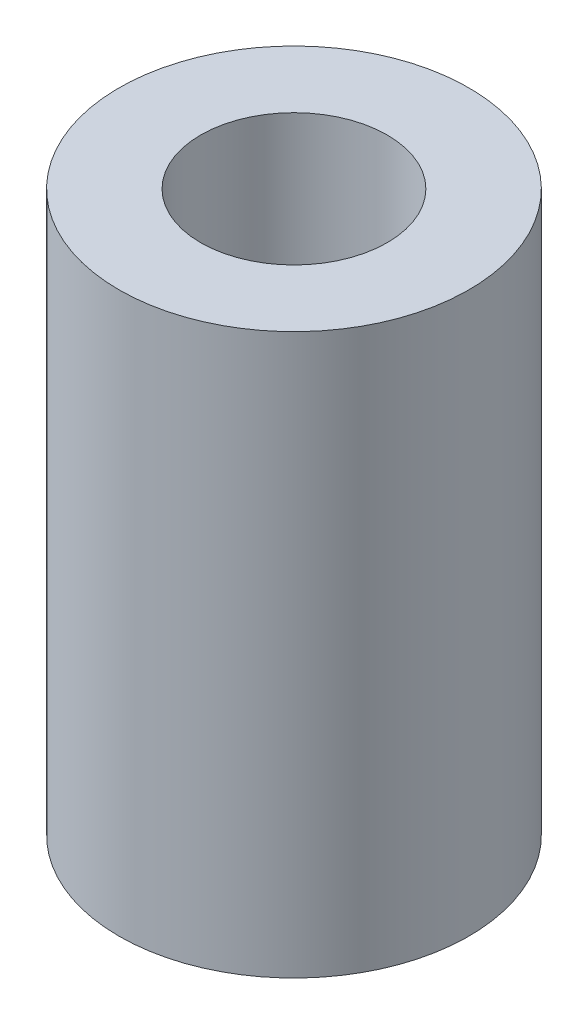
ISO-10303-21;
HEADER;
FILE_DESCRIPTION(('STEP AP214'),'2;1');
FILE_NAME('part.step','',(''),(''),'','','');
FILE_SCHEMA(('AUTOMOTIVE_DESIGN { 1 0 10303 214 1 1 1 1 }'));
ENDSEC;
DATA;
#1=APPLICATION_CONTEXT('core data for automotive mechanical design processes');
#2=APPLICATION_PROTOCOL_DEFINITION('international standard','automotive_design',2000,#1);
#3=PRODUCT_CONTEXT('',#1,'mechanical');
#4=PRODUCT('Part','Part','',(#3));
#5=PRODUCT_RELATED_PRODUCT_CATEGORY('part','',(#4));
#6=PRODUCT_DEFINITION_FORMATION('','',#4);
#7=PRODUCT_DEFINITION_CONTEXT('part definition',#1,'design');
#8=PRODUCT_DEFINITION('design','',#6,#7);
#9=PRODUCT_DEFINITION_SHAPE('','',#8);
#10=(LENGTH_UNIT() NAMED_UNIT(*) SI_UNIT(.MILLI.,.METRE.));
#11=(NAMED_UNIT(*) PLANE_ANGLE_UNIT() SI_UNIT($,.RADIAN.));
#12=(NAMED_UNIT(*) SI_UNIT($,.STERADIAN.) SOLID_ANGLE_UNIT());
#13=UNCERTAINTY_MEASURE_WITH_UNIT(LENGTH_MEASURE(1.E-05),#10,'distance_accuracy_value','');
#14=(GEOMETRIC_REPRESENTATION_CONTEXT(3) GLOBAL_UNCERTAINTY_ASSIGNED_CONTEXT((#13)) GLOBAL_UNIT_ASSIGNED_CONTEXT((#10,
#11,#12)) REPRESENTATION_CONTEXT('',''));
#15=CARTESIAN_POINT('',(0.,0.,0.));
#16=DIRECTION('',(0.,0.,1.));
#17=DIRECTION('',(1.,0.,0.));
#18=AXIS2_PLACEMENT_3D('',#15,#16,#17);
#19=CARTESIAN_POINT('',(0.,24.0000028,0.));
#20=DIRECTION('',(0.,1.,0.));
#21=DIRECTION('',(0.,0.,1.));
#22=AXIS2_PLACEMENT_3D('',#19,#20,#21);
#23=PLANE('',#22);
#24=CARTESIAN_POINT('',(0.,24.0000028,0.));
#25=DIRECTION('',(0.,1.,0.));
#26=DIRECTION('',(0.,0.,1.));
#27=AXIS2_PLACEMENT_3D('',#24,#25,#26);
#28=CIRCLE('',#27,7.4999977);
#29=CARTESIAN_POINT('',(0.,24.0000028,7.4999977));
#30=VERTEX_POINT('',#29);
#31=EDGE_CURVE('E10',#30,#30,#28,.T.);
#32=ORIENTED_EDGE('',*,*,#31,.T.);
#33=EDGE_LOOP('',(#32));
#34=FACE_BOUND('',#33,.T.);
#35=CARTESIAN_POINT('',(0.,24.0000028,0.));
#36=DIRECTION('',(0.,1.,0.));
#37=DIRECTION('',(0.,0.,1.));
#38=AXIS2_PLACEMENT_3D('',#35,#36,#37);
#39=CIRCLE('',#38,4.0000047);
#40=CARTESIAN_POINT('',(0.,24.0000028,4.0000047));
#41=VERTEX_POINT('',#40);
#42=EDGE_CURVE('E42',#41,#41,#39,.T.);
#43=ORIENTED_EDGE('',*,*,#42,.F.);
#44=EDGE_LOOP('',(#43));
#45=FACE_BOUND('',#44,.T.);
#46=ADVANCED_FACE('F31',(#34,#45),#23,.T.);
#47=CARTESIAN_POINT('',(0.,0.,0.));
#48=DIRECTION('',(0.,1.,0.));
#49=DIRECTION('',(0.,0.,1.));
#50=AXIS2_PLACEMENT_3D('',#47,#48,#49);
#51=PLANE('',#50);
#52=CARTESIAN_POINT('',(0.,0.,0.));
#53=DIRECTION('',(0.,1.,0.));
#54=DIRECTION('',(0.,0.,1.));
#55=AXIS2_PLACEMENT_3D('',#52,#53,#54);
#56=CIRCLE('',#55,7.4999977);
#57=CARTESIAN_POINT('',(0.,0.,7.4999977));
#58=VERTEX_POINT('',#57);
#59=EDGE_CURVE('E35',#58,#58,#56,.T.);
#60=ORIENTED_EDGE('',*,*,#59,.F.);
#61=EDGE_LOOP('',(#60));
#62=FACE_BOUND('',#61,.T.);
#63=CARTESIAN_POINT('',(0.,0.,0.));
#64=DIRECTION('',(0.,1.,0.));
#65=DIRECTION('',(0.,0.,1.));
#66=AXIS2_PLACEMENT_3D('',#63,#64,#65);
#67=CIRCLE('',#66,4.0000047);
#68=CARTESIAN_POINT('',(0.,0.,4.0000047));
#69=VERTEX_POINT('',#68);
#70=EDGE_CURVE('E44',#69,#69,#67,.T.);
#71=ORIENTED_EDGE('',*,*,#70,.T.);
#72=EDGE_LOOP('',(#71));
#73=FACE_BOUND('',#72,.T.);
#74=ADVANCED_FACE('F54',(#62,#73),#51,.F.);
#75=CARTESIAN_POINT('',(0.,24.0000028,0.));
#76=DIRECTION('',(0.,-1.,0.));
#77=DIRECTION('',(0.,0.,-1.));
#78=AXIS2_PLACEMENT_3D('',#75,#76,#77);
#79=CYLINDRICAL_SURFACE('',#78,7.4999977);
#80=ORIENTED_EDGE('',*,*,#31,.F.);
#81=EDGE_LOOP('',(#80));
#82=FACE_BOUND('',#81,.T.);
#83=ORIENTED_EDGE('',*,*,#59,.T.);
#84=EDGE_LOOP('',(#83));
#85=FACE_BOUND('',#84,.T.);
#86=ADVANCED_FACE('F33',(#82,#85),#79,.T.);
#87=CARTESIAN_POINT('',(0.,24.0000028,0.));
#88=DIRECTION('',(0.,-1.,0.));
#89=DIRECTION('',(0.,0.,-1.));
#90=AXIS2_PLACEMENT_3D('',#87,#88,#89);
#91=CYLINDRICAL_SURFACE('',#90,4.0000047);
#92=ORIENTED_EDGE('',*,*,#42,.T.);
#93=EDGE_LOOP('',(#92));
#94=FACE_BOUND('',#93,.T.);
#95=ORIENTED_EDGE('',*,*,#70,.F.);
#96=EDGE_LOOP('',(#95));
#97=FACE_BOUND('',#96,.T.);
#98=ADVANCED_FACE('F50',(#94,#97),#91,.F.);
#99=CLOSED_SHELL('',(#46,#74,#86,#98));
#100=MANIFOLD_SOLID_BREP('B2',#99);
#101=ADVANCED_BREP_SHAPE_REPRESENTATION('',(#18,#100),#14);
#102=SHAPE_DEFINITION_REPRESENTATION(#9,#101);
ENDSEC;
END-ISO-10303-21;
